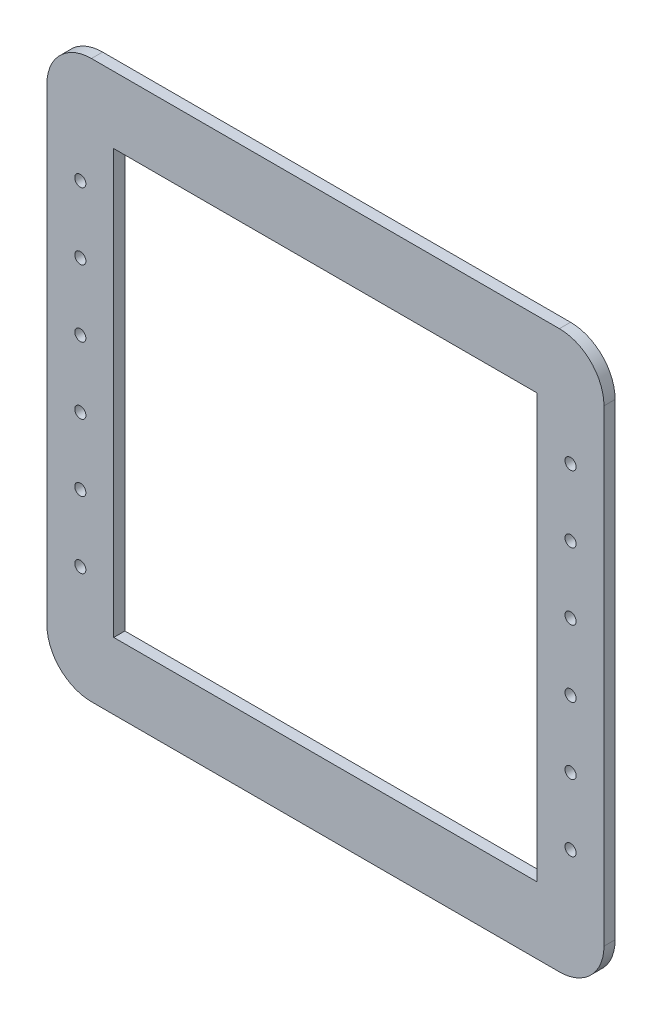
ISO-10303-21;
HEADER;
FILE_DESCRIPTION(('STEP AP214'),'2;1');
FILE_NAME('part.step','',(''),(''),'','','');
FILE_SCHEMA(('AUTOMOTIVE_DESIGN { 1 0 10303 214 1 1 1 1 }'));
ENDSEC;
DATA;
#1=APPLICATION_CONTEXT('core data for automotive mechanical design processes');
#2=APPLICATION_PROTOCOL_DEFINITION('international standard','automotive_design',2000,#1);
#3=PRODUCT_CONTEXT('',#1,'mechanical');
#4=PRODUCT('Part','Part','',(#3));
#5=PRODUCT_RELATED_PRODUCT_CATEGORY('part','',(#4));
#6=PRODUCT_DEFINITION_FORMATION('','',#4);
#7=PRODUCT_DEFINITION_CONTEXT('part definition',#1,'design');
#8=PRODUCT_DEFINITION('design','',#6,#7);
#9=PRODUCT_DEFINITION_SHAPE('','',#8);
#10=(LENGTH_UNIT() NAMED_UNIT(*) SI_UNIT(.MILLI.,.METRE.));
#11=(NAMED_UNIT(*) PLANE_ANGLE_UNIT() SI_UNIT($,.RADIAN.));
#12=(NAMED_UNIT(*) SI_UNIT($,.STERADIAN.) SOLID_ANGLE_UNIT());
#13=UNCERTAINTY_MEASURE_WITH_UNIT(LENGTH_MEASURE(1.E-05),#10,'distance_accuracy_value','');
#14=(GEOMETRIC_REPRESENTATION_CONTEXT(3) GLOBAL_UNCERTAINTY_ASSIGNED_CONTEXT((#13)) GLOBAL_UNIT_ASSIGNED_CONTEXT((#10,
#11,#12)) REPRESENTATION_CONTEXT('',''));
#15=CARTESIAN_POINT('',(0.,0.,0.));
#16=DIRECTION('',(0.,0.,1.));
#17=DIRECTION('',(1.,0.,0.));
#18=AXIS2_PLACEMENT_3D('',#15,#16,#17);
#19=CARTESIAN_POINT('',(110.,-75.,0.));
#20=DIRECTION('',(0.,0.,1.));
#21=DIRECTION('',(1.,0.,0.));
#22=AXIS2_PLACEMENT_3D('',#19,#20,#21);
#23=CYLINDRICAL_SURFACE('',#22,2.5);
#24=CARTESIAN_POINT('',(110.,-75.,0.));
#25=DIRECTION('',(0.,0.,1.));
#26=DIRECTION('',(1.,0.,0.));
#27=AXIS2_PLACEMENT_3D('',#24,#25,#26);
#28=CIRCLE('',#27,2.5);
#29=CARTESIAN_POINT('',(112.5,-75.,0.));
#30=VERTEX_POINT('',#29);
#31=EDGE_CURVE('E45',#30,#30,#28,.T.);
#32=ORIENTED_EDGE('',*,*,#31,.F.);
#33=EDGE_LOOP('',(#32));
#34=FACE_BOUND('',#33,.T.);
#35=CARTESIAN_POINT('',(110.,-75.,5.));
#36=DIRECTION('',(0.,0.,1.));
#37=DIRECTION('',(1.,0.,0.));
#38=AXIS2_PLACEMENT_3D('',#35,#36,#37);
#39=CIRCLE('',#38,2.5);
#40=CARTESIAN_POINT('',(112.5,-75.,5.));
#41=VERTEX_POINT('',#40);
#42=EDGE_CURVE('E11',#41,#41,#39,.T.);
#43=ORIENTED_EDGE('',*,*,#42,.T.);
#44=EDGE_LOOP('',(#43));
#45=FACE_BOUND('',#44,.T.);
#46=ADVANCED_FACE('F38',(#34,#45),#23,.F.);
#47=CARTESIAN_POINT('',(110.,-45.,0.));
#48=DIRECTION('',(0.,0.,1.));
#49=DIRECTION('',(1.,0.,0.));
#50=AXIS2_PLACEMENT_3D('',#47,#48,#49);
#51=CYLINDRICAL_SURFACE('',#50,2.5);
#52=CARTESIAN_POINT('',(110.,-45.,0.));
#53=DIRECTION('',(0.,0.,1.));
#54=DIRECTION('',(1.,0.,0.));
#55=AXIS2_PLACEMENT_3D('',#52,#53,#54);
#56=CIRCLE('',#55,2.5);
#57=CARTESIAN_POINT('',(112.5,-45.,0.));
#58=VERTEX_POINT('',#57);
#59=EDGE_CURVE('E259',#58,#58,#56,.T.);
#60=ORIENTED_EDGE('',*,*,#59,.F.);
#61=EDGE_LOOP('',(#60));
#62=FACE_BOUND('',#61,.T.);
#63=CARTESIAN_POINT('',(110.,-45.,5.));
#64=DIRECTION('',(0.,0.,1.));
#65=DIRECTION('',(1.,0.,0.));
#66=AXIS2_PLACEMENT_3D('',#63,#64,#65);
#67=CIRCLE('',#66,2.5);
#68=CARTESIAN_POINT('',(112.5,-45.,5.));
#69=VERTEX_POINT('',#68);
#70=EDGE_CURVE('E262',#69,#69,#67,.T.);
#71=ORIENTED_EDGE('',*,*,#70,.T.);
#72=EDGE_LOOP('',(#71));
#73=FACE_BOUND('',#72,.T.);
#74=ADVANCED_FACE('F271',(#62,#73),#51,.F.);
#75=CARTESIAN_POINT('',(110.,-15.,0.));
#76=DIRECTION('',(0.,0.,1.));
#77=DIRECTION('',(1.,0.,0.));
#78=AXIS2_PLACEMENT_3D('',#75,#76,#77);
#79=CYLINDRICAL_SURFACE('',#78,2.5);
#80=CARTESIAN_POINT('',(110.,-15.,0.));
#81=DIRECTION('',(0.,0.,1.));
#82=DIRECTION('',(1.,0.,0.));
#83=AXIS2_PLACEMENT_3D('',#80,#81,#82);
#84=CIRCLE('',#83,2.5);
#85=CARTESIAN_POINT('',(112.5,-15.,0.));
#86=VERTEX_POINT('',#85);
#87=EDGE_CURVE('E253',#86,#86,#84,.T.);
#88=ORIENTED_EDGE('',*,*,#87,.F.);
#89=EDGE_LOOP('',(#88));
#90=FACE_BOUND('',#89,.T.);
#91=CARTESIAN_POINT('',(110.,-15.,5.));
#92=DIRECTION('',(0.,0.,1.));
#93=DIRECTION('',(1.,0.,0.));
#94=AXIS2_PLACEMENT_3D('',#91,#92,#93);
#95=CIRCLE('',#94,2.5);
#96=CARTESIAN_POINT('',(112.5,-15.,5.));
#97=VERTEX_POINT('',#96);
#98=EDGE_CURVE('E256',#97,#97,#95,.T.);
#99=ORIENTED_EDGE('',*,*,#98,.T.);
#100=EDGE_LOOP('',(#99));
#101=FACE_BOUND('',#100,.T.);
#102=ADVANCED_FACE('F339',(#90,#101),#79,.F.);
#103=CARTESIAN_POINT('',(110.,15.,0.));
#104=DIRECTION('',(0.,0.,1.));
#105=DIRECTION('',(1.,0.,0.));
#106=AXIS2_PLACEMENT_3D('',#103,#104,#105);
#107=CYLINDRICAL_SURFACE('',#106,2.5);
#108=CARTESIAN_POINT('',(110.,15.,0.));
#109=DIRECTION('',(0.,0.,1.));
#110=DIRECTION('',(1.,0.,0.));
#111=AXIS2_PLACEMENT_3D('',#108,#109,#110);
#112=CIRCLE('',#111,2.5);
#113=CARTESIAN_POINT('',(112.5,15.,0.));
#114=VERTEX_POINT('',#113);
#115=EDGE_CURVE('E247',#114,#114,#112,.T.);
#116=ORIENTED_EDGE('',*,*,#115,.F.);
#117=EDGE_LOOP('',(#116));
#118=FACE_BOUND('',#117,.T.);
#119=CARTESIAN_POINT('',(110.,15.,5.));
#120=DIRECTION('',(0.,0.,1.));
#121=DIRECTION('',(1.,0.,0.));
#122=AXIS2_PLACEMENT_3D('',#119,#120,#121);
#123=CIRCLE('',#122,2.5);
#124=CARTESIAN_POINT('',(112.5,15.,5.));
#125=VERTEX_POINT('',#124);
#126=EDGE_CURVE('E250',#125,#125,#123,.T.);
#127=ORIENTED_EDGE('',*,*,#126,.T.);
#128=EDGE_LOOP('',(#127));
#129=FACE_BOUND('',#128,.T.);
#130=ADVANCED_FACE('F335',(#118,#129),#107,.F.);
#131=CARTESIAN_POINT('',(-110.,-75.,0.));
#132=DIRECTION('',(0.,0.,1.));
#133=DIRECTION('',(1.,0.,0.));
#134=AXIS2_PLACEMENT_3D('',#131,#132,#133);
#135=CYLINDRICAL_SURFACE('',#134,2.5);
#136=CARTESIAN_POINT('',(-110.,-75.,0.));
#137=DIRECTION('',(0.,0.,1.));
#138=DIRECTION('',(1.,0.,0.));
#139=AXIS2_PLACEMENT_3D('',#136,#137,#138);
#140=CIRCLE('',#139,2.5);
#141=CARTESIAN_POINT('',(-107.5,-75.,0.));
#142=VERTEX_POINT('',#141);
#143=EDGE_CURVE('E241',#142,#142,#140,.T.);
#144=ORIENTED_EDGE('',*,*,#143,.F.);
#145=EDGE_LOOP('',(#144));
#146=FACE_BOUND('',#145,.T.);
#147=CARTESIAN_POINT('',(-110.,-75.,5.));
#148=DIRECTION('',(0.,0.,1.));
#149=DIRECTION('',(1.,0.,0.));
#150=AXIS2_PLACEMENT_3D('',#147,#148,#149);
#151=CIRCLE('',#150,2.5);
#152=CARTESIAN_POINT('',(-107.5,-75.,5.));
#153=VERTEX_POINT('',#152);
#154=EDGE_CURVE('E244',#153,#153,#151,.T.);
#155=ORIENTED_EDGE('',*,*,#154,.T.);
#156=EDGE_LOOP('',(#155));
#157=FACE_BOUND('',#156,.T.);
#158=ADVANCED_FACE('F331',(#146,#157),#135,.F.);
#159=CARTESIAN_POINT('',(-110.,-45.,0.));
#160=DIRECTION('',(0.,0.,1.));
#161=DIRECTION('',(1.,0.,0.));
#162=AXIS2_PLACEMENT_3D('',#159,#160,#161);
#163=CYLINDRICAL_SURFACE('',#162,2.5);
#164=CARTESIAN_POINT('',(-110.,-45.,0.));
#165=DIRECTION('',(0.,0.,1.));
#166=DIRECTION('',(1.,0.,0.));
#167=AXIS2_PLACEMENT_3D('',#164,#165,#166);
#168=CIRCLE('',#167,2.5);
#169=CARTESIAN_POINT('',(-107.5,-45.,0.));
#170=VERTEX_POINT('',#169);
#171=EDGE_CURVE('E235',#170,#170,#168,.T.);
#172=ORIENTED_EDGE('',*,*,#171,.F.);
#173=EDGE_LOOP('',(#172));
#174=FACE_BOUND('',#173,.T.);
#175=CARTESIAN_POINT('',(-110.,-45.,5.));
#176=DIRECTION('',(0.,0.,1.));
#177=DIRECTION('',(1.,0.,0.));
#178=AXIS2_PLACEMENT_3D('',#175,#176,#177);
#179=CIRCLE('',#178,2.5);
#180=CARTESIAN_POINT('',(-107.5,-45.,5.));
#181=VERTEX_POINT('',#180);
#182=EDGE_CURVE('E238',#181,#181,#179,.T.);
#183=ORIENTED_EDGE('',*,*,#182,.T.);
#184=EDGE_LOOP('',(#183));
#185=FACE_BOUND('',#184,.T.);
#186=ADVANCED_FACE('F327',(#174,#185),#163,.F.);
#187=CARTESIAN_POINT('',(-110.,-15.,0.));
#188=DIRECTION('',(0.,0.,1.));
#189=DIRECTION('',(1.,0.,0.));
#190=AXIS2_PLACEMENT_3D('',#187,#188,#189);
#191=CYLINDRICAL_SURFACE('',#190,2.5);
#192=CARTESIAN_POINT('',(-110.,-15.,0.));
#193=DIRECTION('',(0.,0.,1.));
#194=DIRECTION('',(1.,0.,0.));
#195=AXIS2_PLACEMENT_3D('',#192,#193,#194);
#196=CIRCLE('',#195,2.5);
#197=CARTESIAN_POINT('',(-107.5,-15.,0.));
#198=VERTEX_POINT('',#197);
#199=EDGE_CURVE('E229',#198,#198,#196,.T.);
#200=ORIENTED_EDGE('',*,*,#199,.F.);
#201=EDGE_LOOP('',(#200));
#202=FACE_BOUND('',#201,.T.);
#203=CARTESIAN_POINT('',(-110.,-15.,5.));
#204=DIRECTION('',(0.,0.,1.));
#205=DIRECTION('',(1.,0.,0.));
#206=AXIS2_PLACEMENT_3D('',#203,#204,#205);
#207=CIRCLE('',#206,2.5);
#208=CARTESIAN_POINT('',(-107.5,-15.,5.));
#209=VERTEX_POINT('',#208);
#210=EDGE_CURVE('E232',#209,#209,#207,.T.);
#211=ORIENTED_EDGE('',*,*,#210,.T.);
#212=EDGE_LOOP('',(#211));
#213=FACE_BOUND('',#212,.T.);
#214=ADVANCED_FACE('F286',(#202,#213),#191,.F.);
#215=CARTESIAN_POINT('',(-110.,15.,0.));
#216=DIRECTION('',(0.,0.,1.));
#217=DIRECTION('',(1.,0.,0.));
#218=AXIS2_PLACEMENT_3D('',#215,#216,#217);
#219=CYLINDRICAL_SURFACE('',#218,2.5);
#220=CARTESIAN_POINT('',(-110.,15.,0.));
#221=DIRECTION('',(0.,0.,1.));
#222=DIRECTION('',(1.,0.,0.));
#223=AXIS2_PLACEMENT_3D('',#220,#221,#222);
#224=CIRCLE('',#223,2.5);
#225=CARTESIAN_POINT('',(-107.5,15.,0.));
#226=VERTEX_POINT('',#225);
#227=EDGE_CURVE('E223',#226,#226,#224,.T.);
#228=ORIENTED_EDGE('',*,*,#227,.F.);
#229=EDGE_LOOP('',(#228));
#230=FACE_BOUND('',#229,.T.);
#231=CARTESIAN_POINT('',(-110.,15.,5.));
#232=DIRECTION('',(0.,0.,1.));
#233=DIRECTION('',(1.,0.,0.));
#234=AXIS2_PLACEMENT_3D('',#231,#232,#233);
#235=CIRCLE('',#234,2.5);
#236=CARTESIAN_POINT('',(-107.5,15.,5.));
#237=VERTEX_POINT('',#236);
#238=EDGE_CURVE('E226',#237,#237,#235,.T.);
#239=ORIENTED_EDGE('',*,*,#238,.T.);
#240=EDGE_LOOP('',(#239));
#241=FACE_BOUND('',#240,.T.);
#242=ADVANCED_FACE('F275',(#230,#241),#219,.F.);
#243=CARTESIAN_POINT('',(-105.,-105.,5.));
#244=DIRECTION('',(0.,0.,1.));
#245=DIRECTION('',(1.,0.,0.));
#246=AXIS2_PLACEMENT_3D('',#243,#244,#245);
#247=PLANE('',#246);
#248=CARTESIAN_POINT('',(110.,45.,5.));
#249=DIRECTION('',(0.,0.,1.));
#250=DIRECTION('',(1.,0.,0.));
#251=AXIS2_PLACEMENT_3D('',#248,#249,#250);
#252=CIRCLE('',#251,2.5);
#253=CARTESIAN_POINT('',(112.5,45.,5.));
#254=VERTEX_POINT('',#253);
#255=EDGE_CURVE('E617',#254,#254,#252,.T.);
#256=ORIENTED_EDGE('',*,*,#255,.F.);
#257=EDGE_LOOP('',(#256));
#258=FACE_BOUND('',#257,.T.);
#259=CARTESIAN_POINT('',(-110.,45.,5.));
#260=DIRECTION('',(0.,0.,1.));
#261=DIRECTION('',(1.,0.,0.));
#262=AXIS2_PLACEMENT_3D('',#259,#260,#261);
#263=CIRCLE('',#262,2.5);
#264=CARTESIAN_POINT('',(-107.5,45.,5.));
#265=VERTEX_POINT('',#264);
#266=EDGE_CURVE('E621',#265,#265,#263,.T.);
#267=ORIENTED_EDGE('',*,*,#266,.F.);
#268=EDGE_LOOP('',(#267));
#269=FACE_BOUND('',#268,.T.);
#270=CARTESIAN_POINT('',(-110.,75.,5.));
#271=DIRECTION('',(0.,0.,1.));
#272=DIRECTION('',(1.,0.,0.));
#273=AXIS2_PLACEMENT_3D('',#270,#271,#272);
#274=CIRCLE('',#273,2.5);
#275=CARTESIAN_POINT('',(-107.5,75.,5.));
#276=VERTEX_POINT('',#275);
#277=EDGE_CURVE('E630',#276,#276,#274,.T.);
#278=ORIENTED_EDGE('',*,*,#277,.F.);
#279=EDGE_LOOP('',(#278));
#280=FACE_BOUND('',#279,.T.);
#281=CARTESIAN_POINT('',(110.,75.,5.));
#282=DIRECTION('',(0.,0.,1.));
#283=DIRECTION('',(1.,0.,0.));
#284=AXIS2_PLACEMENT_3D('',#281,#282,#283);
#285=CIRCLE('',#284,2.5);
#286=CARTESIAN_POINT('',(112.5,75.,5.));
#287=VERTEX_POINT('',#286);
#288=EDGE_CURVE('E633',#287,#287,#285,.T.);
#289=ORIENTED_EDGE('',*,*,#288,.F.);
#290=EDGE_LOOP('',(#289));
#291=FACE_BOUND('',#290,.T.);
#292=CARTESIAN_POINT('',(-105.,-105.,5.));
#293=DIRECTION('',(0.,0.,1.));
#294=DIRECTION('',(1.,0.,0.));
#295=AXIS2_PLACEMENT_3D('',#292,#293,#294);
#296=CIRCLE('',#295,20.);
#297=CARTESIAN_POINT('',(-125.,-105.,5.));
#298=VERTEX_POINT('',#297);
#299=CARTESIAN_POINT('',(-105.,-125.,5.));
#300=VERTEX_POINT('',#299);
#301=EDGE_CURVE('E166',#298,#300,#296,.T.);
#302=ORIENTED_EDGE('',*,*,#301,.T.);
#303=DIRECTION('',(1.,0.,0.));
#304=VECTOR('',#303,1.);
#305=CARTESIAN_POINT('',(-105.,-125.,5.));
#306=LINE('',#305,#304);
#307=CARTESIAN_POINT('',(105.,-125.,5.));
#308=VERTEX_POINT('',#307);
#309=EDGE_CURVE('E169',#300,#308,#306,.T.);
#310=ORIENTED_EDGE('',*,*,#309,.T.);
#311=CARTESIAN_POINT('',(105.,-105.,5.));
#312=DIRECTION('',(0.,0.,1.));
#313=DIRECTION('',(1.,0.,0.));
#314=AXIS2_PLACEMENT_3D('',#311,#312,#313);
#315=CIRCLE('',#314,20.);
#316=CARTESIAN_POINT('',(125.,-105.,5.));
#317=VERTEX_POINT('',#316);
#318=EDGE_CURVE('E172',#308,#317,#315,.T.);
#319=ORIENTED_EDGE('',*,*,#318,.T.);
#320=DIRECTION('',(0.,1.,0.));
#321=VECTOR('',#320,1.);
#322=CARTESIAN_POINT('',(125.,105.,5.));
#323=LINE('',#322,#321);
#324=CARTESIAN_POINT('',(125.,105.,5.));
#325=VERTEX_POINT('',#324);
#326=EDGE_CURVE('E174',#317,#325,#323,.T.);
#327=ORIENTED_EDGE('',*,*,#326,.T.);
#328=CARTESIAN_POINT('',(105.,105.,5.));
#329=DIRECTION('',(0.,0.,1.));
#330=DIRECTION('',(-1.,0.,0.));
#331=AXIS2_PLACEMENT_3D('',#328,#329,#330);
#332=CIRCLE('',#331,20.);
#333=CARTESIAN_POINT('',(105.,125.,5.));
#334=VERTEX_POINT('',#333);
#335=EDGE_CURVE('E176',#325,#334,#332,.T.);
#336=ORIENTED_EDGE('',*,*,#335,.T.);
#337=DIRECTION('',(-1.,0.,0.));
#338=VECTOR('',#337,1.);
#339=CARTESIAN_POINT('',(-105.,125.,5.));
#340=LINE('',#339,#338);
#341=CARTESIAN_POINT('',(-105.,125.,5.));
#342=VERTEX_POINT('',#341);
#343=EDGE_CURVE('E178',#334,#342,#340,.T.);
#344=ORIENTED_EDGE('',*,*,#343,.T.);
#345=CARTESIAN_POINT('',(-105.,105.,5.));
#346=DIRECTION('',(0.,0.,1.));
#347=DIRECTION('',(1.,0.,0.));
#348=AXIS2_PLACEMENT_3D('',#345,#346,#347);
#349=CIRCLE('',#348,20.);
#350=CARTESIAN_POINT('',(-125.,105.,5.));
#351=VERTEX_POINT('',#350);
#352=EDGE_CURVE('E180',#342,#351,#349,.T.);
#353=ORIENTED_EDGE('',*,*,#352,.T.);
#354=DIRECTION('',(0.,-1.,0.));
#355=VECTOR('',#354,1.);
#356=CARTESIAN_POINT('',(-125.,105.,5.));
#357=LINE('',#356,#355);
#358=EDGE_CURVE('E182',#351,#298,#357,.T.);
#359=ORIENTED_EDGE('',*,*,#358,.T.);
#360=EDGE_LOOP('',(#302,#310,#319,#327,#336,#344,#353,#359));
#361=FACE_BOUND('',#360,.T.);
#362=DIRECTION('',(0.,-1.,0.));
#363=VECTOR('',#362,1.);
#364=CARTESIAN_POINT('',(-95.,95.,5.));
#365=LINE('',#364,#363);
#366=CARTESIAN_POINT('',(-95.,95.,5.));
#367=VERTEX_POINT('',#366);
#368=CARTESIAN_POINT('',(-94.9999999999999,-95.,5.));
#369=VERTEX_POINT('',#368);
#370=EDGE_CURVE('E134',#367,#369,#365,.T.);
#371=ORIENTED_EDGE('',*,*,#370,.F.);
#372=DIRECTION('',(-1.,0.,0.));
#373=VECTOR('',#372,1.);
#374=CARTESIAN_POINT('',(-95.,95.,5.));
#375=LINE('',#374,#373);
#376=CARTESIAN_POINT('',(95.,95.,5.));
#377=VERTEX_POINT('',#376);
#378=EDGE_CURVE('E126',#377,#367,#375,.T.);
#379=ORIENTED_EDGE('',*,*,#378,.F.);
#380=DIRECTION('',(0.,1.,0.));
#381=VECTOR('',#380,1.);
#382=CARTESIAN_POINT('',(95.,95.,5.));
#383=LINE('',#382,#381);
#384=CARTESIAN_POINT('',(95.,-95.,5.));
#385=VERTEX_POINT('',#384);
#386=EDGE_CURVE('E150',#385,#377,#383,.T.);
#387=ORIENTED_EDGE('',*,*,#386,.F.);
#388=DIRECTION('',(1.,0.,0.));
#389=VECTOR('',#388,1.);
#390=CARTESIAN_POINT('',(-94.9999999999999,-95.,5.));
#391=LINE('',#390,#389);
#392=EDGE_CURVE('E148',#369,#385,#391,.T.);
#393=ORIENTED_EDGE('',*,*,#392,.F.);
#394=EDGE_LOOP('',(#371,#379,#387,#393));
#395=FACE_BOUND('',#394,.T.);
#396=ORIENTED_EDGE('',*,*,#238,.F.);
#397=EDGE_LOOP('',(#396));
#398=FACE_BOUND('',#397,.T.);
#399=ORIENTED_EDGE('',*,*,#210,.F.);
#400=EDGE_LOOP('',(#399));
#401=FACE_BOUND('',#400,.T.);
#402=ORIENTED_EDGE('',*,*,#182,.F.);
#403=EDGE_LOOP('',(#402));
#404=FACE_BOUND('',#403,.T.);
#405=ORIENTED_EDGE('',*,*,#154,.F.);
#406=EDGE_LOOP('',(#405));
#407=FACE_BOUND('',#406,.T.);
#408=ORIENTED_EDGE('',*,*,#126,.F.);
#409=EDGE_LOOP('',(#408));
#410=FACE_BOUND('',#409,.T.);
#411=ORIENTED_EDGE('',*,*,#98,.F.);
#412=EDGE_LOOP('',(#411));
#413=FACE_BOUND('',#412,.T.);
#414=ORIENTED_EDGE('',*,*,#70,.F.);
#415=EDGE_LOOP('',(#414));
#416=FACE_BOUND('',#415,.T.);
#417=ORIENTED_EDGE('',*,*,#42,.F.);
#418=EDGE_LOOP('',(#417));
#419=FACE_BOUND('',#418,.T.);
#420=ADVANCED_FACE('F146',(#258,#269,#280,#291,#361,#395,#398,#401,#404,#407,#410,#413,#416,
#419),#247,.T.);
#421=CARTESIAN_POINT('',(-105.,-105.,0.));
#422=DIRECTION('',(0.,0.,1.));
#423=DIRECTION('',(1.,0.,0.));
#424=AXIS2_PLACEMENT_3D('',#421,#422,#423);
#425=PLANE('',#424);
#426=CARTESIAN_POINT('',(110.,45.,0.));
#427=DIRECTION('',(0.,0.,1.));
#428=DIRECTION('',(1.,0.,0.));
#429=AXIS2_PLACEMENT_3D('',#426,#427,#428);
#430=CIRCLE('',#429,2.5);
#431=CARTESIAN_POINT('',(112.5,45.,0.));
#432=VERTEX_POINT('',#431);
#433=EDGE_CURVE('E615',#432,#432,#430,.T.);
#434=ORIENTED_EDGE('',*,*,#433,.T.);
#435=EDGE_LOOP('',(#434));
#436=FACE_BOUND('',#435,.T.);
#437=CARTESIAN_POINT('',(-110.,45.,0.));
#438=DIRECTION('',(0.,0.,1.));
#439=DIRECTION('',(1.,0.,0.));
#440=AXIS2_PLACEMENT_3D('',#437,#438,#439);
#441=CIRCLE('',#440,2.5);
#442=CARTESIAN_POINT('',(-107.5,45.,0.));
#443=VERTEX_POINT('',#442);
#444=EDGE_CURVE('E618',#443,#443,#441,.T.);
#445=ORIENTED_EDGE('',*,*,#444,.T.);
#446=EDGE_LOOP('',(#445));
#447=FACE_BOUND('',#446,.T.);
#448=CARTESIAN_POINT('',(-110.,75.,0.));
#449=DIRECTION('',(0.,0.,1.));
#450=DIRECTION('',(1.,0.,0.));
#451=AXIS2_PLACEMENT_3D('',#448,#449,#450);
#452=CIRCLE('',#451,2.5);
#453=CARTESIAN_POINT('',(-107.5,75.,0.));
#454=VERTEX_POINT('',#453);
#455=EDGE_CURVE('E156',#454,#454,#452,.T.);
#456=ORIENTED_EDGE('',*,*,#455,.T.);
#457=EDGE_LOOP('',(#456));
#458=FACE_BOUND('',#457,.T.);
#459=CARTESIAN_POINT('',(110.,75.,0.));
#460=DIRECTION('',(0.,0.,1.));
#461=DIRECTION('',(1.,0.,0.));
#462=AXIS2_PLACEMENT_3D('',#459,#460,#461);
#463=CIRCLE('',#462,2.5);
#464=CARTESIAN_POINT('',(112.5,75.,0.));
#465=VERTEX_POINT('',#464);
#466=EDGE_CURVE('E627',#465,#465,#463,.T.);
#467=ORIENTED_EDGE('',*,*,#466,.T.);
#468=EDGE_LOOP('',(#467));
#469=FACE_BOUND('',#468,.T.);
#470=CARTESIAN_POINT('',(-105.,-105.,0.));
#471=DIRECTION('',(0.,0.,1.));
#472=DIRECTION('',(1.,0.,0.));
#473=AXIS2_PLACEMENT_3D('',#470,#471,#472);
#474=CIRCLE('',#473,20.);
#475=CARTESIAN_POINT('',(-125.,-105.,0.));
#476=VERTEX_POINT('',#475);
#477=CARTESIAN_POINT('',(-105.,-125.,0.));
#478=VERTEX_POINT('',#477);
#479=EDGE_CURVE('E142',#476,#478,#474,.T.);
#480=ORIENTED_EDGE('',*,*,#479,.F.);
#481=DIRECTION('',(0.,-1.,0.));
#482=VECTOR('',#481,1.);
#483=CARTESIAN_POINT('',(-125.,105.,0.));
#484=LINE('',#483,#482);
#485=CARTESIAN_POINT('',(-125.,105.,0.));
#486=VERTEX_POINT('',#485);
#487=EDGE_CURVE('E170',#486,#476,#484,.T.);
#488=ORIENTED_EDGE('',*,*,#487,.F.);
#489=CARTESIAN_POINT('',(-105.,105.,0.));
#490=DIRECTION('',(0.,0.,1.));
#491=DIRECTION('',(1.,0.,0.));
#492=AXIS2_PLACEMENT_3D('',#489,#490,#491);
#493=CIRCLE('',#492,20.);
#494=CARTESIAN_POINT('',(-105.,125.,0.));
#495=VERTEX_POINT('',#494);
#496=EDGE_CURVE('E197',#495,#486,#493,.T.);
#497=ORIENTED_EDGE('',*,*,#496,.F.);
#498=DIRECTION('',(-1.,0.,0.));
#499=VECTOR('',#498,1.);
#500=CARTESIAN_POINT('',(-105.,125.,0.));
#501=LINE('',#500,#499);
#502=CARTESIAN_POINT('',(105.,125.,0.));
#503=VERTEX_POINT('',#502);
#504=EDGE_CURVE('E195',#503,#495,#501,.T.);
#505=ORIENTED_EDGE('',*,*,#504,.F.);
#506=CARTESIAN_POINT('',(105.,105.,0.));
#507=DIRECTION('',(0.,0.,1.));
#508=DIRECTION('',(-1.,0.,0.));
#509=AXIS2_PLACEMENT_3D('',#506,#507,#508);
#510=CIRCLE('',#509,20.);
#511=CARTESIAN_POINT('',(125.,105.,0.));
#512=VERTEX_POINT('',#511);
#513=EDGE_CURVE('E193',#512,#503,#510,.T.);
#514=ORIENTED_EDGE('',*,*,#513,.F.);
#515=DIRECTION('',(0.,1.,0.));
#516=VECTOR('',#515,1.);
#517=CARTESIAN_POINT('',(125.,105.,0.));
#518=LINE('',#517,#516);
#519=CARTESIAN_POINT('',(125.,-105.,0.));
#520=VERTEX_POINT('',#519);
#521=EDGE_CURVE('E191',#520,#512,#518,.T.);
#522=ORIENTED_EDGE('',*,*,#521,.F.);
#523=CARTESIAN_POINT('',(105.,-105.,0.));
#524=DIRECTION('',(0.,0.,1.));
#525=DIRECTION('',(1.,0.,0.));
#526=AXIS2_PLACEMENT_3D('',#523,#524,#525);
#527=CIRCLE('',#526,20.);
#528=CARTESIAN_POINT('',(105.,-125.,0.));
#529=VERTEX_POINT('',#528);
#530=EDGE_CURVE('E189',#529,#520,#527,.T.);
#531=ORIENTED_EDGE('',*,*,#530,.F.);
#532=DIRECTION('',(1.,0.,0.));
#533=VECTOR('',#532,1.);
#534=CARTESIAN_POINT('',(-105.,-125.,0.));
#535=LINE('',#534,#533);
#536=EDGE_CURVE('E187',#478,#529,#535,.T.);
#537=ORIENTED_EDGE('',*,*,#536,.F.);
#538=EDGE_LOOP('',(#480,#488,#497,#505,#514,#522,#531,#537));
#539=FACE_BOUND('',#538,.T.);
#540=DIRECTION('',(-1.,0.,0.));
#541=VECTOR('',#540,1.);
#542=CARTESIAN_POINT('',(-95.,95.,0.));
#543=LINE('',#542,#541);
#544=CARTESIAN_POINT('',(95.,95.,0.));
#545=VERTEX_POINT('',#544);
#546=CARTESIAN_POINT('',(-95.,95.,0.));
#547=VERTEX_POINT('',#546);
#548=EDGE_CURVE('E60',#545,#547,#543,.T.);
#549=ORIENTED_EDGE('',*,*,#548,.T.);
#550=DIRECTION('',(0.,-1.,0.));
#551=VECTOR('',#550,1.);
#552=CARTESIAN_POINT('',(-95.,95.,0.));
#553=LINE('',#552,#551);
#554=CARTESIAN_POINT('',(-94.9999999999999,-95.,0.));
#555=VERTEX_POINT('',#554);
#556=EDGE_CURVE('E141',#547,#555,#553,.T.);
#557=ORIENTED_EDGE('',*,*,#556,.T.);
#558=DIRECTION('',(1.,0.,0.));
#559=VECTOR('',#558,1.);
#560=CARTESIAN_POINT('',(-94.9999999999999,-95.,0.));
#561=LINE('',#560,#559);
#562=CARTESIAN_POINT('',(95.,-95.,0.));
#563=VERTEX_POINT('',#562);
#564=EDGE_CURVE('E158',#555,#563,#561,.T.);
#565=ORIENTED_EDGE('',*,*,#564,.T.);
#566=DIRECTION('',(0.,1.,0.));
#567=VECTOR('',#566,1.);
#568=CARTESIAN_POINT('',(95.,95.,0.));
#569=LINE('',#568,#567);
#570=EDGE_CURVE('E135',#563,#545,#569,.T.);
#571=ORIENTED_EDGE('',*,*,#570,.T.);
#572=EDGE_LOOP('',(#549,#557,#565,#571));
#573=FACE_BOUND('',#572,.T.);
#574=ORIENTED_EDGE('',*,*,#227,.T.);
#575=EDGE_LOOP('',(#574));
#576=FACE_BOUND('',#575,.T.);
#577=ORIENTED_EDGE('',*,*,#199,.T.);
#578=EDGE_LOOP('',(#577));
#579=FACE_BOUND('',#578,.T.);
#580=ORIENTED_EDGE('',*,*,#171,.T.);
#581=EDGE_LOOP('',(#580));
#582=FACE_BOUND('',#581,.T.);
#583=ORIENTED_EDGE('',*,*,#143,.T.);
#584=EDGE_LOOP('',(#583));
#585=FACE_BOUND('',#584,.T.);
#586=ORIENTED_EDGE('',*,*,#115,.T.);
#587=EDGE_LOOP('',(#586));
#588=FACE_BOUND('',#587,.T.);
#589=ORIENTED_EDGE('',*,*,#87,.T.);
#590=EDGE_LOOP('',(#589));
#591=FACE_BOUND('',#590,.T.);
#592=ORIENTED_EDGE('',*,*,#59,.T.);
#593=EDGE_LOOP('',(#592));
#594=FACE_BOUND('',#593,.T.);
#595=ORIENTED_EDGE('',*,*,#31,.T.);
#596=EDGE_LOOP('',(#595));
#597=FACE_BOUND('',#596,.T.);
#598=ADVANCED_FACE('F267',(#436,#447,#458,#469,#539,#573,#576,#579,#582,#585,#588,#591,#594,
#597),#425,.F.);
#599=CARTESIAN_POINT('',(-105.,-105.,5.));
#600=DIRECTION('',(0.,0.,-1.));
#601=DIRECTION('',(-1.,0.,0.));
#602=AXIS2_PLACEMENT_3D('',#599,#600,#601);
#603=CYLINDRICAL_SURFACE('',#602,20.);
#604=ORIENTED_EDGE('',*,*,#479,.T.);
#605=DIRECTION('',(0.,0.,-1.));
#606=VECTOR('',#605,1.);
#607=CARTESIAN_POINT('',(-105.,-125.,5.));
#608=LINE('',#607,#606);
#609=EDGE_CURVE('E220',#300,#478,#608,.T.);
#610=ORIENTED_EDGE('',*,*,#609,.F.);
#611=ORIENTED_EDGE('',*,*,#301,.F.);
#612=DIRECTION('',(0.,0.,-1.));
#613=VECTOR('',#612,1.);
#614=CARTESIAN_POINT('',(-125.,-105.,5.));
#615=LINE('',#614,#613);
#616=EDGE_CURVE('E184',#298,#476,#615,.T.);
#617=ORIENTED_EDGE('',*,*,#616,.T.);
#618=EDGE_LOOP('',(#604,#610,#611,#617));
#619=FACE_BOUND('',#618,.T.);
#620=ADVANCED_FACE('F282',(#619),#603,.T.);
#621=CARTESIAN_POINT('',(-105.,-125.,5.));
#622=DIRECTION('',(0.,1.,0.));
#623=DIRECTION('',(0.,0.,1.));
#624=AXIS2_PLACEMENT_3D('',#621,#622,#623);
#625=PLANE('',#624);
#626=ORIENTED_EDGE('',*,*,#536,.T.);
#627=DIRECTION('',(0.,0.,-1.));
#628=VECTOR('',#627,1.);
#629=CARTESIAN_POINT('',(105.,-125.,5.));
#630=LINE('',#629,#628);
#631=EDGE_CURVE('E217',#308,#529,#630,.T.);
#632=ORIENTED_EDGE('',*,*,#631,.F.);
#633=ORIENTED_EDGE('',*,*,#309,.F.);
#634=ORIENTED_EDGE('',*,*,#609,.T.);
#635=EDGE_LOOP('',(#626,#632,#633,#634));
#636=FACE_BOUND('',#635,.T.);
#637=ADVANCED_FACE('F317',(#636),#625,.F.);
#638=CARTESIAN_POINT('',(105.,-105.,5.));
#639=DIRECTION('',(0.,0.,-1.));
#640=DIRECTION('',(-1.,0.,0.));
#641=AXIS2_PLACEMENT_3D('',#638,#639,#640);
#642=CYLINDRICAL_SURFACE('',#641,20.);
#643=ORIENTED_EDGE('',*,*,#530,.T.);
#644=DIRECTION('',(0.,0.,-1.));
#645=VECTOR('',#644,1.);
#646=CARTESIAN_POINT('',(125.,-105.,5.));
#647=LINE('',#646,#645);
#648=EDGE_CURVE('E214',#317,#520,#647,.T.);
#649=ORIENTED_EDGE('',*,*,#648,.F.);
#650=ORIENTED_EDGE('',*,*,#318,.F.);
#651=ORIENTED_EDGE('',*,*,#631,.T.);
#652=EDGE_LOOP('',(#643,#649,#650,#651));
#653=FACE_BOUND('',#652,.T.);
#654=ADVANCED_FACE('F313',(#653),#642,.T.);
#655=CARTESIAN_POINT('',(125.,105.,5.));
#656=DIRECTION('',(-1.,0.,0.));
#657=DIRECTION('',(0.,-1.,0.));
#658=AXIS2_PLACEMENT_3D('',#655,#656,#657);
#659=PLANE('',#658);
#660=ORIENTED_EDGE('',*,*,#521,.T.);
#661=DIRECTION('',(0.,0.,-1.));
#662=VECTOR('',#661,1.);
#663=CARTESIAN_POINT('',(125.,105.,5.));
#664=LINE('',#663,#662);
#665=EDGE_CURVE('E211',#325,#512,#664,.T.);
#666=ORIENTED_EDGE('',*,*,#665,.F.);
#667=ORIENTED_EDGE('',*,*,#326,.F.);
#668=ORIENTED_EDGE('',*,*,#648,.T.);
#669=EDGE_LOOP('',(#660,#666,#667,#668));
#670=FACE_BOUND('',#669,.T.);
#671=ADVANCED_FACE('F309',(#670),#659,.F.);
#672=CARTESIAN_POINT('',(105.,105.,5.));
#673=DIRECTION('',(0.,0.,-1.));
#674=DIRECTION('',(-1.,0.,0.));
#675=AXIS2_PLACEMENT_3D('',#672,#673,#674);
#676=CYLINDRICAL_SURFACE('',#675,20.);
#677=ORIENTED_EDGE('',*,*,#513,.T.);
#678=DIRECTION('',(0.,0.,-1.));
#679=VECTOR('',#678,1.);
#680=CARTESIAN_POINT('',(105.,125.,5.));
#681=LINE('',#680,#679);
#682=EDGE_CURVE('E208',#334,#503,#681,.T.);
#683=ORIENTED_EDGE('',*,*,#682,.F.);
#684=ORIENTED_EDGE('',*,*,#335,.F.);
#685=ORIENTED_EDGE('',*,*,#665,.T.);
#686=EDGE_LOOP('',(#677,#683,#684,#685));
#687=FACE_BOUND('',#686,.T.);
#688=ADVANCED_FACE('F305',(#687),#676,.T.);
#689=CARTESIAN_POINT('',(-105.,125.,5.));
#690=DIRECTION('',(0.,-1.,0.));
#691=DIRECTION('',(1.,0.,0.));
#692=AXIS2_PLACEMENT_3D('',#689,#690,#691);
#693=PLANE('',#692);
#694=ORIENTED_EDGE('',*,*,#504,.T.);
#695=DIRECTION('',(0.,0.,-1.));
#696=VECTOR('',#695,1.);
#697=CARTESIAN_POINT('',(-105.,125.,5.));
#698=LINE('',#697,#696);
#699=EDGE_CURVE('E205',#342,#495,#698,.T.);
#700=ORIENTED_EDGE('',*,*,#699,.F.);
#701=ORIENTED_EDGE('',*,*,#343,.F.);
#702=ORIENTED_EDGE('',*,*,#682,.T.);
#703=EDGE_LOOP('',(#694,#700,#701,#702));
#704=FACE_BOUND('',#703,.T.);
#705=ADVANCED_FACE('F301',(#704),#693,.F.);
#706=CARTESIAN_POINT('',(-105.,105.,5.));
#707=DIRECTION('',(0.,0.,-1.));
#708=DIRECTION('',(-1.,0.,0.));
#709=AXIS2_PLACEMENT_3D('',#706,#707,#708);
#710=CYLINDRICAL_SURFACE('',#709,20.);
#711=ORIENTED_EDGE('',*,*,#496,.T.);
#712=DIRECTION('',(0.,0.,-1.));
#713=VECTOR('',#712,1.);
#714=CARTESIAN_POINT('',(-125.,105.,5.));
#715=LINE('',#714,#713);
#716=EDGE_CURVE('E202',#351,#486,#715,.T.);
#717=ORIENTED_EDGE('',*,*,#716,.F.);
#718=ORIENTED_EDGE('',*,*,#352,.F.);
#719=ORIENTED_EDGE('',*,*,#699,.T.);
#720=EDGE_LOOP('',(#711,#717,#718,#719));
#721=FACE_BOUND('',#720,.T.);
#722=ADVANCED_FACE('F297',(#721),#710,.T.);
#723=CARTESIAN_POINT('',(-125.,105.,5.));
#724=DIRECTION('',(1.,0.,0.));
#725=DIRECTION('',(0.,1.,0.));
#726=AXIS2_PLACEMENT_3D('',#723,#724,#725);
#727=PLANE('',#726);
#728=ORIENTED_EDGE('',*,*,#487,.T.);
#729=ORIENTED_EDGE('',*,*,#616,.F.);
#730=ORIENTED_EDGE('',*,*,#358,.F.);
#731=ORIENTED_EDGE('',*,*,#716,.T.);
#732=EDGE_LOOP('',(#728,#729,#730,#731));
#733=FACE_BOUND('',#732,.T.);
#734=ADVANCED_FACE('F294',(#733),#727,.F.);
#735=CARTESIAN_POINT('',(-95.,95.,5.));
#736=DIRECTION('',(0.,-1.,0.));
#737=DIRECTION('',(0.,0.,-1.));
#738=AXIS2_PLACEMENT_3D('',#735,#736,#737);
#739=PLANE('',#738);
#740=ORIENTED_EDGE('',*,*,#548,.F.);
#741=DIRECTION('',(0.,0.,-1.));
#742=VECTOR('',#741,1.);
#743=CARTESIAN_POINT('',(95.,95.,5.));
#744=LINE('',#743,#742);
#745=EDGE_CURVE('E130',#377,#545,#744,.T.);
#746=ORIENTED_EDGE('',*,*,#745,.F.);
#747=ORIENTED_EDGE('',*,*,#378,.T.);
#748=DIRECTION('',(0.,0.,-1.));
#749=VECTOR('',#748,1.);
#750=CARTESIAN_POINT('',(-95.,95.,5.));
#751=LINE('',#750,#749);
#752=EDGE_CURVE('E129',#367,#547,#751,.T.);
#753=ORIENTED_EDGE('',*,*,#752,.T.);
#754=EDGE_LOOP('',(#740,#746,#747,#753));
#755=FACE_BOUND('',#754,.T.);
#756=ADVANCED_FACE('F128',(#755),#739,.T.);
#757=CARTESIAN_POINT('',(-95.,95.,5.));
#758=DIRECTION('',(1.,0.,0.));
#759=DIRECTION('',(0.,1.,0.));
#760=AXIS2_PLACEMENT_3D('',#757,#758,#759);
#761=PLANE('',#760);
#762=ORIENTED_EDGE('',*,*,#556,.F.);
#763=ORIENTED_EDGE('',*,*,#752,.F.);
#764=ORIENTED_EDGE('',*,*,#370,.T.);
#765=DIRECTION('',(0.,0.,-1.));
#766=VECTOR('',#765,1.);
#767=CARTESIAN_POINT('',(-94.9999999999999,-95.,5.));
#768=LINE('',#767,#766);
#769=EDGE_CURVE('E143',#369,#555,#768,.T.);
#770=ORIENTED_EDGE('',*,*,#769,.T.);
#771=EDGE_LOOP('',(#762,#763,#764,#770));
#772=FACE_BOUND('',#771,.T.);
#773=ADVANCED_FACE('F138',(#772),#761,.T.);
#774=CARTESIAN_POINT('',(-94.9999999999999,-95.,5.));
#775=DIRECTION('',(0.,1.,0.));
#776=DIRECTION('',(0.,0.,1.));
#777=AXIS2_PLACEMENT_3D('',#774,#775,#776);
#778=PLANE('',#777);
#779=ORIENTED_EDGE('',*,*,#564,.F.);
#780=ORIENTED_EDGE('',*,*,#769,.F.);
#781=ORIENTED_EDGE('',*,*,#392,.T.);
#782=DIRECTION('',(0.,0.,-1.));
#783=VECTOR('',#782,1.);
#784=CARTESIAN_POINT('',(95.,-95.,5.));
#785=LINE('',#784,#783);
#786=EDGE_CURVE('E52',#385,#563,#785,.T.);
#787=ORIENTED_EDGE('',*,*,#786,.T.);
#788=EDGE_LOOP('',(#779,#780,#781,#787));
#789=FACE_BOUND('',#788,.T.);
#790=ADVANCED_FACE('F469',(#789),#778,.T.);
#791=CARTESIAN_POINT('',(95.,95.,5.));
#792=DIRECTION('',(-1.,0.,0.));
#793=DIRECTION('',(0.,0.,1.));
#794=AXIS2_PLACEMENT_3D('',#791,#792,#793);
#795=PLANE('',#794);
#796=ORIENTED_EDGE('',*,*,#570,.F.);
#797=ORIENTED_EDGE('',*,*,#786,.F.);
#798=ORIENTED_EDGE('',*,*,#386,.T.);
#799=ORIENTED_EDGE('',*,*,#745,.T.);
#800=EDGE_LOOP('',(#796,#797,#798,#799));
#801=FACE_BOUND('',#800,.T.);
#802=ADVANCED_FACE('F386',(#801),#795,.T.);
#803=CARTESIAN_POINT('',(110.,75.,0.));
#804=DIRECTION('',(0.,0.,1.));
#805=DIRECTION('',(1.,0.,0.));
#806=AXIS2_PLACEMENT_3D('',#803,#804,#805);
#807=CYLINDRICAL_SURFACE('',#806,2.5);
#808=ORIENTED_EDGE('',*,*,#466,.F.);
#809=EDGE_LOOP('',(#808));
#810=FACE_BOUND('',#809,.T.);
#811=ORIENTED_EDGE('',*,*,#288,.T.);
#812=EDGE_LOOP('',(#811));
#813=FACE_BOUND('',#812,.T.);
#814=ADVANCED_FACE('F381',(#810,#813),#807,.F.);
#815=CARTESIAN_POINT('',(-110.,75.,0.));
#816=DIRECTION('',(0.,0.,1.));
#817=DIRECTION('',(1.,0.,0.));
#818=AXIS2_PLACEMENT_3D('',#815,#816,#817);
#819=CYLINDRICAL_SURFACE('',#818,2.5);
#820=ORIENTED_EDGE('',*,*,#455,.F.);
#821=EDGE_LOOP('',(#820));
#822=FACE_BOUND('',#821,.T.);
#823=ORIENTED_EDGE('',*,*,#277,.T.);
#824=EDGE_LOOP('',(#823));
#825=FACE_BOUND('',#824,.T.);
#826=ADVANCED_FACE('F385',(#822,#825),#819,.F.);
#827=CARTESIAN_POINT('',(-110.,45.,0.));
#828=DIRECTION('',(0.,0.,1.));
#829=DIRECTION('',(1.,0.,0.));
#830=AXIS2_PLACEMENT_3D('',#827,#828,#829);
#831=CYLINDRICAL_SURFACE('',#830,2.5);
#832=ORIENTED_EDGE('',*,*,#444,.F.);
#833=EDGE_LOOP('',(#832));
#834=FACE_BOUND('',#833,.T.);
#835=ORIENTED_EDGE('',*,*,#266,.T.);
#836=EDGE_LOOP('',(#835));
#837=FACE_BOUND('',#836,.T.);
#838=ADVANCED_FACE('F395',(#834,#837),#831,.F.);
#839=CARTESIAN_POINT('',(110.,45.,0.));
#840=DIRECTION('',(0.,0.,1.));
#841=DIRECTION('',(1.,0.,0.));
#842=AXIS2_PLACEMENT_3D('',#839,#840,#841);
#843=CYLINDRICAL_SURFACE('',#842,2.5);
#844=ORIENTED_EDGE('',*,*,#433,.F.);
#845=EDGE_LOOP('',(#844));
#846=FACE_BOUND('',#845,.T.);
#847=ORIENTED_EDGE('',*,*,#255,.T.);
#848=EDGE_LOOP('',(#847));
#849=FACE_BOUND('',#848,.T.);
#850=ADVANCED_FACE('F403',(#846,#849),#843,.F.);
#851=CLOSED_SHELL('',(#46,#74,#102,#130,#158,#186,#214,#242,#420,#598,#620,#637,#654,#671,#688,
#705,#722,#734,#756,#773,#790,#802,#814,#826,#838,#850));
#852=MANIFOLD_SOLID_BREP('B2',#851);
#853=ADVANCED_BREP_SHAPE_REPRESENTATION('',(#18,#852),#14);
#854=SHAPE_DEFINITION_REPRESENTATION(#9,#853);
ENDSEC;
END-ISO-10303-21;
